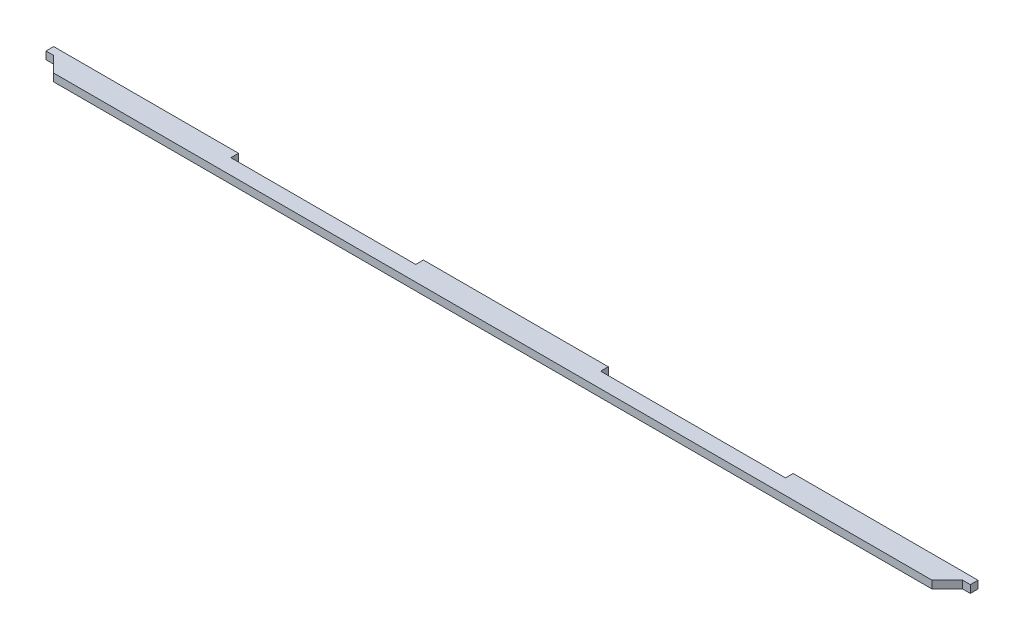
ISO-10303-21;
HEADER;
FILE_DESCRIPTION(('STEP AP214'),'2;1');
FILE_NAME('part.step','',(''),(''),'','','');
FILE_SCHEMA(('AUTOMOTIVE_DESIGN { 1 0 10303 214 1 1 1 1 }'));
ENDSEC;
DATA;
#1=APPLICATION_CONTEXT('core data for automotive mechanical design processes');
#2=APPLICATION_PROTOCOL_DEFINITION('international standard','automotive_design',2000,#1);
#3=PRODUCT_CONTEXT('',#1,'mechanical');
#4=PRODUCT('Part','Part','',(#3));
#5=PRODUCT_RELATED_PRODUCT_CATEGORY('part','',(#4));
#6=PRODUCT_DEFINITION_FORMATION('','',#4);
#7=PRODUCT_DEFINITION_CONTEXT('part definition',#1,'design');
#8=PRODUCT_DEFINITION('design','',#6,#7);
#9=PRODUCT_DEFINITION_SHAPE('','',#8);
#10=(LENGTH_UNIT() NAMED_UNIT(*) SI_UNIT(.MILLI.,.METRE.));
#11=(NAMED_UNIT(*) PLANE_ANGLE_UNIT() SI_UNIT($,.RADIAN.));
#12=(NAMED_UNIT(*) SI_UNIT($,.STERADIAN.) SOLID_ANGLE_UNIT());
#13=UNCERTAINTY_MEASURE_WITH_UNIT(LENGTH_MEASURE(1.E-05),#10,'distance_accuracy_value','');
#14=(GEOMETRIC_REPRESENTATION_CONTEXT(3) GLOBAL_UNCERTAINTY_ASSIGNED_CONTEXT((#13)) GLOBAL_UNIT_ASSIGNED_CONTEXT((#10,
#11,#12)) REPRESENTATION_CONTEXT('',''));
#15=CARTESIAN_POINT('',(0.,0.,0.));
#16=DIRECTION('',(0.,0.,1.));
#17=DIRECTION('',(1.,0.,0.));
#18=AXIS2_PLACEMENT_3D('',#15,#16,#17);
#19=CARTESIAN_POINT('',(-108.69,3.,-1.07887162492054));
#20=DIRECTION('',(0.,0.,1.));
#21=DIRECTION('',(1.,0.,0.));
#22=AXIS2_PLACEMENT_3D('',#19,#20,#21);
#23=PLANE('',#22);
#24=DIRECTION('',(-1.,0.,0.));
#25=VECTOR('',#24,1.);
#26=CARTESIAN_POINT('',(-108.69,0.,-1.07887162492054));
#27=LINE('',#26,#25);
#28=CARTESIAN_POINT('',(-36.23,0.,-1.07887162492054));
#29=VERTEX_POINT('',#28);
#30=CARTESIAN_POINT('',(-108.69,0.,-1.07887162492054));
#31=VERTEX_POINT('',#30);
#32=EDGE_CURVE('E178',#29,#31,#27,.T.);
#33=ORIENTED_EDGE('',*,*,#32,.T.);
#34=DIRECTION('',(0.,-1.,0.));
#35=VECTOR('',#34,1.);
#36=CARTESIAN_POINT('',(-108.69,3.,-1.07887162492054));
#37=LINE('',#36,#35);
#38=CARTESIAN_POINT('',(-108.69,3.,-1.07887162492054));
#39=VERTEX_POINT('',#38);
#40=EDGE_CURVE('E11',#39,#31,#37,.T.);
#41=ORIENTED_EDGE('',*,*,#40,.F.);
#42=DIRECTION('',(-1.,0.,0.));
#43=VECTOR('',#42,1.);
#44=CARTESIAN_POINT('',(-108.69,3.,-1.07887162492054));
#45=LINE('',#44,#43);
#46=CARTESIAN_POINT('',(-36.23,3.,-1.07887162492054));
#47=VERTEX_POINT('',#46);
#48=EDGE_CURVE('E208',#47,#39,#45,.T.);
#49=ORIENTED_EDGE('',*,*,#48,.F.);
#50=DIRECTION('',(0.,-1.,0.));
#51=VECTOR('',#50,1.);
#52=CARTESIAN_POINT('',(-36.23,3.,-1.07887162492054));
#53=LINE('',#52,#51);
#54=EDGE_CURVE('E174',#47,#29,#53,.T.);
#55=ORIENTED_EDGE('',*,*,#54,.T.);
#56=EDGE_LOOP('',(#33,#41,#49,#55));
#57=FACE_BOUND('',#56,.T.);
#58=ADVANCED_FACE('F34',(#57),#23,.F.);
#59=CARTESIAN_POINT('',(-108.69,3.,-4.07887162492054));
#60=DIRECTION('',(-1.,0.,0.));
#61=DIRECTION('',(0.,0.,1.));
#62=AXIS2_PLACEMENT_3D('',#59,#60,#61);
#63=PLANE('',#62);
#64=DIRECTION('',(0.,0.,-1.));
#65=VECTOR('',#64,1.);
#66=CARTESIAN_POINT('',(-108.69,0.,-4.07887162492054));
#67=LINE('',#66,#65);
#68=CARTESIAN_POINT('',(-108.69,0.,-4.07887162492054));
#69=VERTEX_POINT('',#68);
#70=EDGE_CURVE('E181',#31,#69,#67,.T.);
#71=ORIENTED_EDGE('',*,*,#70,.T.);
#72=DIRECTION('',(0.,-1.,0.));
#73=VECTOR('',#72,1.);
#74=CARTESIAN_POINT('',(-108.69,3.,-4.07887162492054));
#75=LINE('',#74,#73);
#76=CARTESIAN_POINT('',(-108.69,3.,-4.07887162492054));
#77=VERTEX_POINT('',#76);
#78=EDGE_CURVE('E42',#77,#69,#75,.T.);
#79=ORIENTED_EDGE('',*,*,#78,.F.);
#80=DIRECTION('',(0.,0.,-1.));
#81=VECTOR('',#80,1.);
#82=CARTESIAN_POINT('',(-108.69,3.,-4.07887162492054));
#83=LINE('',#82,#81);
#84=EDGE_CURVE('E117',#39,#77,#83,.T.);
#85=ORIENTED_EDGE('',*,*,#84,.F.);
#86=ORIENTED_EDGE('',*,*,#40,.T.);
#87=EDGE_LOOP('',(#71,#79,#85,#86));
#88=FACE_BOUND('',#87,.T.);
#89=ADVANCED_FACE('F306',(#88),#63,.F.);
#90=CARTESIAN_POINT('',(-181.15,3.,-4.07887162492054));
#91=DIRECTION('',(0.,0.,1.));
#92=DIRECTION('',(1.,0.,0.));
#93=AXIS2_PLACEMENT_3D('',#90,#91,#92);
#94=PLANE('',#93);
#95=DIRECTION('',(-1.,0.,0.));
#96=VECTOR('',#95,1.);
#97=CARTESIAN_POINT('',(-181.15,0.,-4.07887162492054));
#98=LINE('',#97,#96);
#99=CARTESIAN_POINT('',(-181.15,0.,-4.07887162492054));
#100=VERTEX_POINT('',#99);
#101=EDGE_CURVE('E183',#69,#100,#98,.T.);
#102=ORIENTED_EDGE('',*,*,#101,.T.);
#103=DIRECTION('',(0.,-1.,0.));
#104=VECTOR('',#103,1.);
#105=CARTESIAN_POINT('',(-181.15,3.,-4.07887162492054));
#106=LINE('',#105,#104);
#107=CARTESIAN_POINT('',(-181.15,3.,-4.07887162492054));
#108=VERTEX_POINT('',#107);
#109=EDGE_CURVE('E239',#108,#100,#106,.T.);
#110=ORIENTED_EDGE('',*,*,#109,.F.);
#111=DIRECTION('',(-1.,0.,0.));
#112=VECTOR('',#111,1.);
#113=CARTESIAN_POINT('',(-181.15,3.,-4.07887162492054));
#114=LINE('',#113,#112);
#115=EDGE_CURVE('E247',#77,#108,#114,.T.);
#116=ORIENTED_EDGE('',*,*,#115,.F.);
#117=ORIENTED_EDGE('',*,*,#78,.T.);
#118=EDGE_LOOP('',(#102,#110,#116,#117));
#119=FACE_BOUND('',#118,.T.);
#120=ADVANCED_FACE('F245',(#119),#94,.F.);
#121=CARTESIAN_POINT('',(-181.15,3.,-4.07887162492054));
#122=DIRECTION('',(1.,0.,0.));
#123=DIRECTION('',(0.,0.,-1.));
#124=AXIS2_PLACEMENT_3D('',#121,#122,#123);
#125=PLANE('',#124);
#126=DIRECTION('',(0.,0.,1.));
#127=VECTOR('',#126,1.);
#128=CARTESIAN_POINT('',(-181.15,0.,-4.07887162492054));
#129=LINE('',#128,#127);
#130=CARTESIAN_POINT('',(-181.15,0.,-1.07887162492054));
#131=VERTEX_POINT('',#130);
#132=EDGE_CURVE('E185',#100,#131,#129,.T.);
#133=ORIENTED_EDGE('',*,*,#132,.T.);
#134=DIRECTION('',(0.,-1.,0.));
#135=VECTOR('',#134,1.);
#136=CARTESIAN_POINT('',(-181.15,3.,-1.07887162492054));
#137=LINE('',#136,#135);
#138=CARTESIAN_POINT('',(-181.15,3.,-1.07887162492054));
#139=VERTEX_POINT('',#138);
#140=EDGE_CURVE('E236',#139,#131,#137,.T.);
#141=ORIENTED_EDGE('',*,*,#140,.F.);
#142=DIRECTION('',(0.,0.,1.));
#143=VECTOR('',#142,1.);
#144=CARTESIAN_POINT('',(-181.15,3.,-4.07887162492054));
#145=LINE('',#144,#143);
#146=EDGE_CURVE('E265',#108,#139,#145,.T.);
#147=ORIENTED_EDGE('',*,*,#146,.F.);
#148=ORIENTED_EDGE('',*,*,#109,.T.);
#149=EDGE_LOOP('',(#133,#141,#147,#148));
#150=FACE_BOUND('',#149,.T.);
#151=ADVANCED_FACE('F256',(#150),#125,.F.);
#152=CARTESIAN_POINT('',(-181.15,3.,-1.07887162492054));
#153=DIRECTION('',(0.,0.,-1.));
#154=DIRECTION('',(-1.,0.,0.));
#155=AXIS2_PLACEMENT_3D('',#152,#153,#154);
#156=PLANE('',#155);
#157=DIRECTION('',(1.,0.,0.));
#158=VECTOR('',#157,1.);
#159=CARTESIAN_POINT('',(-181.15,0.,-1.07887162492054));
#160=LINE('',#159,#158);
#161=CARTESIAN_POINT('',(-178.15,0.,-1.07887162492054));
#162=VERTEX_POINT('',#161);
#163=EDGE_CURVE('E187',#131,#162,#160,.T.);
#164=ORIENTED_EDGE('',*,*,#163,.T.);
#165=DIRECTION('',(0.,-1.,0.));
#166=VECTOR('',#165,1.);
#167=CARTESIAN_POINT('',(-178.15,3.,-1.07887162492054));
#168=LINE('',#167,#166);
#169=CARTESIAN_POINT('',(-178.15,3.,-1.07887162492054));
#170=VERTEX_POINT('',#169);
#171=EDGE_CURVE('E233',#170,#162,#168,.T.);
#172=ORIENTED_EDGE('',*,*,#171,.F.);
#173=DIRECTION('',(1.,0.,0.));
#174=VECTOR('',#173,1.);
#175=CARTESIAN_POINT('',(-181.15,3.,-1.07887162492054));
#176=LINE('',#175,#174);
#177=EDGE_CURVE('E262',#139,#170,#176,.T.);
#178=ORIENTED_EDGE('',*,*,#177,.F.);
#179=ORIENTED_EDGE('',*,*,#140,.T.);
#180=EDGE_LOOP('',(#164,#172,#178,#179));
#181=FACE_BOUND('',#180,.T.);
#182=ADVANCED_FACE('F260',(#181),#156,.F.);
#183=CARTESIAN_POINT('',(-178.15,3.,-1.07887162492054));
#184=DIRECTION('',(0.707106781186539,0.,-0.707106781186556));
#185=DIRECTION('',(-0.707106781186556,0.,-0.707106781186539));
#186=AXIS2_PLACEMENT_3D('',#183,#184,#185);
#187=PLANE('',#186);
#188=DIRECTION('',(0.707106781186556,0.,0.707106781186539));
#189=VECTOR('',#188,1.);
#190=CARTESIAN_POINT('',(-178.15,0.,-1.07887162492054));
#191=LINE('',#190,#189);
#192=CARTESIAN_POINT('',(-172.15,0.,4.92112837507946));
#193=VERTEX_POINT('',#192);
#194=EDGE_CURVE('E189',#162,#193,#191,.T.);
#195=ORIENTED_EDGE('',*,*,#194,.T.);
#196=DIRECTION('',(0.,-1.,0.));
#197=VECTOR('',#196,1.);
#198=CARTESIAN_POINT('',(-172.15,3.,4.92112837507946));
#199=LINE('',#198,#197);
#200=CARTESIAN_POINT('',(-172.15,3.,4.92112837507946));
#201=VERTEX_POINT('',#200);
#202=EDGE_CURVE('E230',#201,#193,#199,.T.);
#203=ORIENTED_EDGE('',*,*,#202,.F.);
#204=DIRECTION('',(0.707106781186556,0.,0.707106781186539));
#205=VECTOR('',#204,1.);
#206=CARTESIAN_POINT('',(-178.15,3.,-1.07887162492054));
#207=LINE('',#206,#205);
#208=EDGE_CURVE('E264',#170,#201,#207,.T.);
#209=ORIENTED_EDGE('',*,*,#208,.F.);
#210=ORIENTED_EDGE('',*,*,#171,.T.);
#211=EDGE_LOOP('',(#195,#203,#209,#210));
#212=FACE_BOUND('',#211,.T.);
#213=ADVANCED_FACE('F319',(#212),#187,.F.);
#214=CARTESIAN_POINT('',(-172.15,3.,4.92112837507946));
#215=DIRECTION('',(0.,0.,-1.));
#216=DIRECTION('',(-1.,0.,0.));
#217=AXIS2_PLACEMENT_3D('',#214,#215,#216);
#218=PLANE('',#217);
#219=DIRECTION('',(1.,0.,0.));
#220=VECTOR('',#219,1.);
#221=CARTESIAN_POINT('',(-172.15,0.,4.92112837507946));
#222=LINE('',#221,#220);
#223=CARTESIAN_POINT('',(172.15,0.,4.92112837507946));
#224=VERTEX_POINT('',#223);
#225=EDGE_CURVE('E191',#193,#224,#222,.T.);
#226=ORIENTED_EDGE('',*,*,#225,.T.);
#227=DIRECTION('',(0.,-1.,0.));
#228=VECTOR('',#227,1.);
#229=CARTESIAN_POINT('',(172.15,3.,4.92112837507946));
#230=LINE('',#229,#228);
#231=CARTESIAN_POINT('',(172.15,3.,4.92112837507946));
#232=VERTEX_POINT('',#231);
#233=EDGE_CURVE('E227',#232,#224,#230,.T.);
#234=ORIENTED_EDGE('',*,*,#233,.F.);
#235=DIRECTION('',(1.,0.,0.));
#236=VECTOR('',#235,1.);
#237=CARTESIAN_POINT('',(-172.15,3.,4.92112837507946));
#238=LINE('',#237,#236);
#239=EDGE_CURVE('E267',#201,#232,#238,.T.);
#240=ORIENTED_EDGE('',*,*,#239,.F.);
#241=ORIENTED_EDGE('',*,*,#202,.T.);
#242=EDGE_LOOP('',(#226,#234,#240,#241));
#243=FACE_BOUND('',#242,.T.);
#244=ADVANCED_FACE('F322',(#243),#218,.F.);
#245=CARTESIAN_POINT('',(178.15,3.,-1.07887162492054));
#246=DIRECTION('',(-0.707106781186554,0.,-0.707106781186541));
#247=DIRECTION('',(-0.707106781186541,0.,0.707106781186554));
#248=AXIS2_PLACEMENT_3D('',#245,#246,#247);
#249=PLANE('',#248);
#250=DIRECTION('',(0.707106781186541,0.,-0.707106781186554));
#251=VECTOR('',#250,1.);
#252=CARTESIAN_POINT('',(178.15,0.,-1.07887162492054));
#253=LINE('',#252,#251);
#254=CARTESIAN_POINT('',(178.15,0.,-1.07887162492054));
#255=VERTEX_POINT('',#254);
#256=EDGE_CURVE('E193',#224,#255,#253,.T.);
#257=ORIENTED_EDGE('',*,*,#256,.T.);
#258=DIRECTION('',(0.,-1.,0.));
#259=VECTOR('',#258,1.);
#260=CARTESIAN_POINT('',(178.15,3.,-1.07887162492054));
#261=LINE('',#260,#259);
#262=CARTESIAN_POINT('',(178.15,3.,-1.07887162492054));
#263=VERTEX_POINT('',#262);
#264=EDGE_CURVE('E224',#263,#255,#261,.T.);
#265=ORIENTED_EDGE('',*,*,#264,.F.);
#266=DIRECTION('',(0.707106781186541,0.,-0.707106781186554));
#267=VECTOR('',#266,1.);
#268=CARTESIAN_POINT('',(178.15,3.,-1.07887162492054));
#269=LINE('',#268,#267);
#270=EDGE_CURVE('E273',#232,#263,#269,.T.);
#271=ORIENTED_EDGE('',*,*,#270,.F.);
#272=ORIENTED_EDGE('',*,*,#233,.T.);
#273=EDGE_LOOP('',(#257,#265,#271,#272));
#274=FACE_BOUND('',#273,.T.);
#275=ADVANCED_FACE('F326',(#274),#249,.F.);
#276=CARTESIAN_POINT('',(178.15,3.,-1.07887162492054));
#277=DIRECTION('',(0.,0.,-1.));
#278=DIRECTION('',(-1.,0.,0.));
#279=AXIS2_PLACEMENT_3D('',#276,#277,#278);
#280=PLANE('',#279);
#281=DIRECTION('',(1.,0.,0.));
#282=VECTOR('',#281,1.);
#283=CARTESIAN_POINT('',(178.15,0.,-1.07887162492054));
#284=LINE('',#283,#282);
#285=CARTESIAN_POINT('',(181.15,0.,-1.07887162492054));
#286=VERTEX_POINT('',#285);
#287=EDGE_CURVE('E195',#255,#286,#284,.T.);
#288=ORIENTED_EDGE('',*,*,#287,.T.);
#289=DIRECTION('',(0.,-1.,0.));
#290=VECTOR('',#289,1.);
#291=CARTESIAN_POINT('',(181.15,3.,-1.07887162492054));
#292=LINE('',#291,#290);
#293=CARTESIAN_POINT('',(181.15,3.,-1.07887162492054));
#294=VERTEX_POINT('',#293);
#295=EDGE_CURVE('E221',#294,#286,#292,.T.);
#296=ORIENTED_EDGE('',*,*,#295,.F.);
#297=DIRECTION('',(1.,0.,0.));
#298=VECTOR('',#297,1.);
#299=CARTESIAN_POINT('',(178.15,3.,-1.07887162492054));
#300=LINE('',#299,#298);
#301=EDGE_CURVE('E275',#263,#294,#300,.T.);
#302=ORIENTED_EDGE('',*,*,#301,.F.);
#303=ORIENTED_EDGE('',*,*,#264,.T.);
#304=EDGE_LOOP('',(#288,#296,#302,#303));
#305=FACE_BOUND('',#304,.T.);
#306=ADVANCED_FACE('F330',(#305),#280,.F.);
#307=CARTESIAN_POINT('',(181.15,3.,-4.07887162492054));
#308=DIRECTION('',(-1.,0.,0.));
#309=DIRECTION('',(0.,0.,1.));
#310=AXIS2_PLACEMENT_3D('',#307,#308,#309);
#311=PLANE('',#310);
#312=DIRECTION('',(0.,0.,-1.));
#313=VECTOR('',#312,1.);
#314=CARTESIAN_POINT('',(181.15,0.,-4.07887162492054));
#315=LINE('',#314,#313);
#316=CARTESIAN_POINT('',(181.15,0.,-4.07887162492054));
#317=VERTEX_POINT('',#316);
#318=EDGE_CURVE('E197',#286,#317,#315,.T.);
#319=ORIENTED_EDGE('',*,*,#318,.T.);
#320=DIRECTION('',(0.,-1.,0.));
#321=VECTOR('',#320,1.);
#322=CARTESIAN_POINT('',(181.15,3.,-4.07887162492054));
#323=LINE('',#322,#321);
#324=CARTESIAN_POINT('',(181.15,3.,-4.07887162492054));
#325=VERTEX_POINT('',#324);
#326=EDGE_CURVE('E218',#325,#317,#323,.T.);
#327=ORIENTED_EDGE('',*,*,#326,.F.);
#328=DIRECTION('',(0.,0.,-1.));
#329=VECTOR('',#328,1.);
#330=CARTESIAN_POINT('',(181.15,3.,-4.07887162492054));
#331=LINE('',#330,#329);
#332=EDGE_CURVE('E277',#294,#325,#331,.T.);
#333=ORIENTED_EDGE('',*,*,#332,.F.);
#334=ORIENTED_EDGE('',*,*,#295,.T.);
#335=EDGE_LOOP('',(#319,#327,#333,#334));
#336=FACE_BOUND('',#335,.T.);
#337=ADVANCED_FACE('F334',(#336),#311,.F.);
#338=CARTESIAN_POINT('',(108.69,3.,-4.07887162492054));
#339=DIRECTION('',(0.,0.,1.));
#340=DIRECTION('',(1.,0.,0.));
#341=AXIS2_PLACEMENT_3D('',#338,#339,#340);
#342=PLANE('',#341);
#343=DIRECTION('',(-1.,0.,0.));
#344=VECTOR('',#343,1.);
#345=CARTESIAN_POINT('',(108.69,0.,-4.07887162492054));
#346=LINE('',#345,#344);
#347=CARTESIAN_POINT('',(108.69,0.,-4.07887162492054));
#348=VERTEX_POINT('',#347);
#349=EDGE_CURVE('E199',#317,#348,#346,.T.);
#350=ORIENTED_EDGE('',*,*,#349,.T.);
#351=DIRECTION('',(0.,-1.,0.));
#352=VECTOR('',#351,1.);
#353=CARTESIAN_POINT('',(108.69,3.,-4.07887162492054));
#354=LINE('',#353,#352);
#355=CARTESIAN_POINT('',(108.69,3.,-4.07887162492054));
#356=VERTEX_POINT('',#355);
#357=EDGE_CURVE('E215',#356,#348,#354,.T.);
#358=ORIENTED_EDGE('',*,*,#357,.F.);
#359=DIRECTION('',(-1.,0.,0.));
#360=VECTOR('',#359,1.);
#361=CARTESIAN_POINT('',(108.69,3.,-4.07887162492054));
#362=LINE('',#361,#360);
#363=EDGE_CURVE('E279',#325,#356,#362,.T.);
#364=ORIENTED_EDGE('',*,*,#363,.F.);
#365=ORIENTED_EDGE('',*,*,#326,.T.);
#366=EDGE_LOOP('',(#350,#358,#364,#365));
#367=FACE_BOUND('',#366,.T.);
#368=ADVANCED_FACE('F338',(#367),#342,.F.);
#369=CARTESIAN_POINT('',(108.69,3.,-4.07887162492054));
#370=DIRECTION('',(1.,0.,0.));
#371=DIRECTION('',(0.,0.,-1.));
#372=AXIS2_PLACEMENT_3D('',#369,#370,#371);
#373=PLANE('',#372);
#374=DIRECTION('',(0.,0.,1.));
#375=VECTOR('',#374,1.);
#376=CARTESIAN_POINT('',(108.69,0.,-4.07887162492054));
#377=LINE('',#376,#375);
#378=CARTESIAN_POINT('',(108.69,0.,-1.07887162492054));
#379=VERTEX_POINT('',#378);
#380=EDGE_CURVE('E201',#348,#379,#377,.T.);
#381=ORIENTED_EDGE('',*,*,#380,.T.);
#382=DIRECTION('',(0.,-1.,0.));
#383=VECTOR('',#382,1.);
#384=CARTESIAN_POINT('',(108.69,3.,-1.07887162492054));
#385=LINE('',#384,#383);
#386=CARTESIAN_POINT('',(108.69,3.,-1.07887162492054));
#387=VERTEX_POINT('',#386);
#388=EDGE_CURVE('E212',#387,#379,#385,.T.);
#389=ORIENTED_EDGE('',*,*,#388,.F.);
#390=DIRECTION('',(0.,0.,1.));
#391=VECTOR('',#390,1.);
#392=CARTESIAN_POINT('',(108.69,3.,-4.07887162492054));
#393=LINE('',#392,#391);
#394=EDGE_CURVE('E281',#356,#387,#393,.T.);
#395=ORIENTED_EDGE('',*,*,#394,.F.);
#396=ORIENTED_EDGE('',*,*,#357,.T.);
#397=EDGE_LOOP('',(#381,#389,#395,#396));
#398=FACE_BOUND('',#397,.T.);
#399=ADVANCED_FACE('F287',(#398),#373,.F.);
#400=CARTESIAN_POINT('',(36.23,3.,-1.07887162492054));
#401=DIRECTION('',(0.,0.,1.));
#402=DIRECTION('',(1.,0.,0.));
#403=AXIS2_PLACEMENT_3D('',#400,#401,#402);
#404=PLANE('',#403);
#405=DIRECTION('',(-1.,0.,0.));
#406=VECTOR('',#405,1.);
#407=CARTESIAN_POINT('',(36.23,0.,-1.07887162492054));
#408=LINE('',#407,#406);
#409=CARTESIAN_POINT('',(36.23,0.,-1.07887162492054));
#410=VERTEX_POINT('',#409);
#411=EDGE_CURVE('E203',#379,#410,#408,.T.);
#412=ORIENTED_EDGE('',*,*,#411,.T.);
#413=DIRECTION('',(0.,-1.,0.));
#414=VECTOR('',#413,1.);
#415=CARTESIAN_POINT('',(36.23,3.,-1.07887162492054));
#416=LINE('',#415,#414);
#417=CARTESIAN_POINT('',(36.23,3.,-1.07887162492054));
#418=VERTEX_POINT('',#417);
#419=EDGE_CURVE('E169',#418,#410,#416,.T.);
#420=ORIENTED_EDGE('',*,*,#419,.F.);
#421=DIRECTION('',(-1.,0.,0.));
#422=VECTOR('',#421,1.);
#423=CARTESIAN_POINT('',(36.23,3.,-1.07887162492054));
#424=LINE('',#423,#422);
#425=EDGE_CURVE('E160',#387,#418,#424,.T.);
#426=ORIENTED_EDGE('',*,*,#425,.F.);
#427=ORIENTED_EDGE('',*,*,#388,.T.);
#428=EDGE_LOOP('',(#412,#420,#426,#427));
#429=FACE_BOUND('',#428,.T.);
#430=ADVANCED_FACE('F291',(#429),#404,.F.);
#431=CARTESIAN_POINT('',(36.23,3.,-4.07887162492054));
#432=DIRECTION('',(-1.,0.,0.));
#433=DIRECTION('',(0.,0.,1.));
#434=AXIS2_PLACEMENT_3D('',#431,#432,#433);
#435=PLANE('',#434);
#436=DIRECTION('',(0.,0.,-1.));
#437=VECTOR('',#436,1.);
#438=CARTESIAN_POINT('',(36.23,0.,-4.07887162492054));
#439=LINE('',#438,#437);
#440=CARTESIAN_POINT('',(36.23,0.,-4.07887162492054));
#441=VERTEX_POINT('',#440);
#442=EDGE_CURVE('E168',#410,#441,#439,.T.);
#443=ORIENTED_EDGE('',*,*,#442,.T.);
#444=DIRECTION('',(0.,-1.,0.));
#445=VECTOR('',#444,1.);
#446=CARTESIAN_POINT('',(36.23,3.,-4.07887162492054));
#447=LINE('',#446,#445);
#448=CARTESIAN_POINT('',(36.23,3.,-4.07887162492054));
#449=VERTEX_POINT('',#448);
#450=EDGE_CURVE('E165',#449,#441,#447,.T.);
#451=ORIENTED_EDGE('',*,*,#450,.F.);
#452=DIRECTION('',(0.,0.,-1.));
#453=VECTOR('',#452,1.);
#454=CARTESIAN_POINT('',(36.23,3.,-4.07887162492054));
#455=LINE('',#454,#453);
#456=EDGE_CURVE('E154',#418,#449,#455,.T.);
#457=ORIENTED_EDGE('',*,*,#456,.F.);
#458=ORIENTED_EDGE('',*,*,#419,.T.);
#459=EDGE_LOOP('',(#443,#451,#457,#458));
#460=FACE_BOUND('',#459,.T.);
#461=ADVANCED_FACE('F166',(#460),#435,.F.);
#462=CARTESIAN_POINT('',(-36.23,3.,-4.07887162492054));
#463=DIRECTION('',(0.,0.,1.));
#464=DIRECTION('',(1.,0.,0.));
#465=AXIS2_PLACEMENT_3D('',#462,#463,#464);
#466=PLANE('',#465);
#467=DIRECTION('',(-1.,0.,0.));
#468=VECTOR('',#467,1.);
#469=CARTESIAN_POINT('',(-36.23,0.,-4.07887162492054));
#470=LINE('',#469,#468);
#471=CARTESIAN_POINT('',(-36.23,0.,-4.07887162492054));
#472=VERTEX_POINT('',#471);
#473=EDGE_CURVE('E103',#441,#472,#470,.T.);
#474=ORIENTED_EDGE('',*,*,#473,.T.);
#475=DIRECTION('',(0.,-1.,0.));
#476=VECTOR('',#475,1.);
#477=CARTESIAN_POINT('',(-36.23,3.,-4.07887162492054));
#478=LINE('',#477,#476);
#479=CARTESIAN_POINT('',(-36.23,3.,-4.07887162492054));
#480=VERTEX_POINT('',#479);
#481=EDGE_CURVE('E170',#480,#472,#478,.T.);
#482=ORIENTED_EDGE('',*,*,#481,.F.);
#483=DIRECTION('',(-1.,0.,0.));
#484=VECTOR('',#483,1.);
#485=CARTESIAN_POINT('',(-36.23,3.,-4.07887162492054));
#486=LINE('',#485,#484);
#487=EDGE_CURVE('E158',#449,#480,#486,.T.);
#488=ORIENTED_EDGE('',*,*,#487,.F.);
#489=ORIENTED_EDGE('',*,*,#450,.T.);
#490=EDGE_LOOP('',(#474,#482,#488,#489));
#491=FACE_BOUND('',#490,.T.);
#492=ADVANCED_FACE('F172',(#491),#466,.F.);
#493=CARTESIAN_POINT('',(-36.23,3.,-4.07887162492054));
#494=DIRECTION('',(1.,0.,0.));
#495=DIRECTION('',(0.,0.,-1.));
#496=AXIS2_PLACEMENT_3D('',#493,#494,#495);
#497=PLANE('',#496);
#498=DIRECTION('',(0.,0.,1.));
#499=VECTOR('',#498,1.);
#500=CARTESIAN_POINT('',(-36.23,0.,-4.07887162492054));
#501=LINE('',#500,#499);
#502=EDGE_CURVE('E109',#472,#29,#501,.T.);
#503=ORIENTED_EDGE('',*,*,#502,.T.);
#504=ORIENTED_EDGE('',*,*,#54,.F.);
#505=DIRECTION('',(0.,0.,1.));
#506=VECTOR('',#505,1.);
#507=CARTESIAN_POINT('',(-36.23,3.,-4.07887162492054));
#508=LINE('',#507,#506);
#509=EDGE_CURVE('E50',#480,#47,#508,.T.);
#510=ORIENTED_EDGE('',*,*,#509,.F.);
#511=ORIENTED_EDGE('',*,*,#481,.T.);
#512=EDGE_LOOP('',(#503,#504,#510,#511));
#513=FACE_BOUND('',#512,.T.);
#514=ADVANCED_FACE('F295',(#513),#497,.F.);
#515=CARTESIAN_POINT('',(0.,3.,0.));
#516=DIRECTION('',(0.,-1.,0.));
#517=DIRECTION('',(0.,0.,-1.));
#518=AXIS2_PLACEMENT_3D('',#515,#516,#517);
#519=PLANE('',#518);
#520=ORIENTED_EDGE('',*,*,#48,.T.);
#521=ORIENTED_EDGE('',*,*,#84,.T.);
#522=ORIENTED_EDGE('',*,*,#115,.T.);
#523=ORIENTED_EDGE('',*,*,#146,.T.);
#524=ORIENTED_EDGE('',*,*,#177,.T.);
#525=ORIENTED_EDGE('',*,*,#208,.T.);
#526=ORIENTED_EDGE('',*,*,#239,.T.);
#527=ORIENTED_EDGE('',*,*,#270,.T.);
#528=ORIENTED_EDGE('',*,*,#301,.T.);
#529=ORIENTED_EDGE('',*,*,#332,.T.);
#530=ORIENTED_EDGE('',*,*,#363,.T.);
#531=ORIENTED_EDGE('',*,*,#394,.T.);
#532=ORIENTED_EDGE('',*,*,#425,.T.);
#533=ORIENTED_EDGE('',*,*,#456,.T.);
#534=ORIENTED_EDGE('',*,*,#487,.T.);
#535=ORIENTED_EDGE('',*,*,#509,.T.);
#536=EDGE_LOOP('',(#520,#521,#522,#523,#524,#525,#526,#527,#528,#529,#530,#531,#532,#533,#534,#535));
#537=FACE_BOUND('',#536,.T.);
#538=ADVANCED_FACE('F156',(#537),#519,.F.);
#539=CARTESIAN_POINT('',(0.,0.,0.));
#540=DIRECTION('',(0.,-1.,0.));
#541=DIRECTION('',(0.,0.,-1.));
#542=AXIS2_PLACEMENT_3D('',#539,#540,#541);
#543=PLANE('',#542);
#544=ORIENTED_EDGE('',*,*,#32,.F.);
#545=ORIENTED_EDGE('',*,*,#502,.F.);
#546=ORIENTED_EDGE('',*,*,#473,.F.);
#547=ORIENTED_EDGE('',*,*,#442,.F.);
#548=ORIENTED_EDGE('',*,*,#411,.F.);
#549=ORIENTED_EDGE('',*,*,#380,.F.);
#550=ORIENTED_EDGE('',*,*,#349,.F.);
#551=ORIENTED_EDGE('',*,*,#318,.F.);
#552=ORIENTED_EDGE('',*,*,#287,.F.);
#553=ORIENTED_EDGE('',*,*,#256,.F.);
#554=ORIENTED_EDGE('',*,*,#225,.F.);
#555=ORIENTED_EDGE('',*,*,#194,.F.);
#556=ORIENTED_EDGE('',*,*,#163,.F.);
#557=ORIENTED_EDGE('',*,*,#132,.F.);
#558=ORIENTED_EDGE('',*,*,#101,.F.);
#559=ORIENTED_EDGE('',*,*,#70,.F.);
#560=EDGE_LOOP('',(#544,#545,#546,#547,#548,#549,#550,#551,#552,#553,#554,#555,#556,#557,#558,#559));
#561=FACE_BOUND('',#560,.T.);
#562=ADVANCED_FACE('F251',(#561),#543,.T.);
#563=CLOSED_SHELL('',(#58,#89,#120,#151,#182,#213,#244,#275,#306,#337,#368,#399,#430,#461,#492,
#514,#538,#562));
#564=MANIFOLD_SOLID_BREP('B2',#563);
#565=ADVANCED_BREP_SHAPE_REPRESENTATION('',(#18,#564),#14);
#566=SHAPE_DEFINITION_REPRESENTATION(#9,#565);
ENDSEC;
END-ISO-10303-21;
